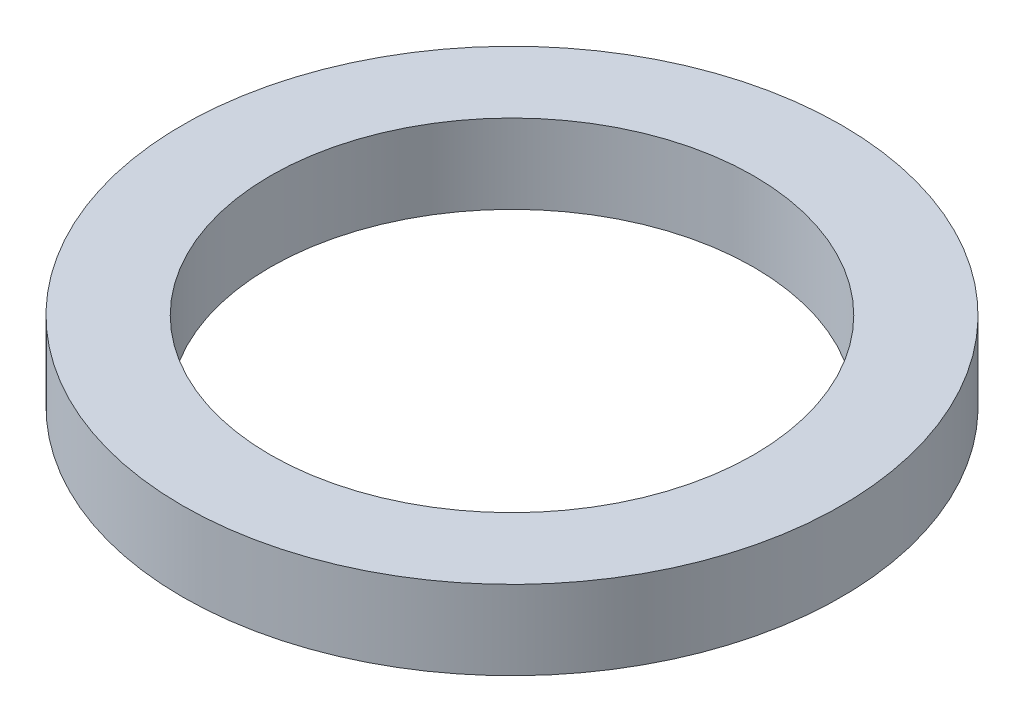
ISO-10303-21;
HEADER;
FILE_DESCRIPTION(('STEP AP214'),'2;1');
FILE_NAME('part.step','',(''),(''),'','','');
FILE_SCHEMA(('AUTOMOTIVE_DESIGN { 1 0 10303 214 1 1 1 1 }'));
ENDSEC;
DATA;
#1=APPLICATION_CONTEXT('core data for automotive mechanical design processes');
#2=APPLICATION_PROTOCOL_DEFINITION('international standard','automotive_design',2000,#1);
#3=PRODUCT_CONTEXT('',#1,'mechanical');
#4=PRODUCT('Part','Part','',(#3));
#5=PRODUCT_RELATED_PRODUCT_CATEGORY('part','',(#4));
#6=PRODUCT_DEFINITION_FORMATION('','',#4);
#7=PRODUCT_DEFINITION_CONTEXT('part definition',#1,'design');
#8=PRODUCT_DEFINITION('design','',#6,#7);
#9=PRODUCT_DEFINITION_SHAPE('','',#8);
#10=(LENGTH_UNIT() NAMED_UNIT(*) SI_UNIT(.MILLI.,.METRE.));
#11=(NAMED_UNIT(*) PLANE_ANGLE_UNIT() SI_UNIT($,.RADIAN.));
#12=(NAMED_UNIT(*) SI_UNIT($,.STERADIAN.) SOLID_ANGLE_UNIT());
#13=UNCERTAINTY_MEASURE_WITH_UNIT(LENGTH_MEASURE(1.E-05),#10,'distance_accuracy_value','');
#14=(GEOMETRIC_REPRESENTATION_CONTEXT(3) GLOBAL_UNCERTAINTY_ASSIGNED_CONTEXT((#13)) GLOBAL_UNIT_ASSIGNED_CONTEXT((#10,
#11,#12)) REPRESENTATION_CONTEXT('',''));
#15=CARTESIAN_POINT('',(0.,0.,0.));
#16=DIRECTION('',(0.,0.,1.));
#17=DIRECTION('',(1.,0.,0.));
#18=AXIS2_PLACEMENT_3D('',#15,#16,#17);
#19=CARTESIAN_POINT('',(0.,9.,0.));
#20=DIRECTION('',(0.,-1.,0.));
#21=DIRECTION('',(0.,0.,-1.));
#22=AXIS2_PLACEMENT_3D('',#19,#20,#21);
#23=CYLINDRICAL_SURFACE('',#22,37.5);
#24=CARTESIAN_POINT('',(0.,9.,0.));
#25=DIRECTION('',(0.,1.,0.));
#26=DIRECTION('',(0.,0.,1.));
#27=AXIS2_PLACEMENT_3D('',#24,#25,#26);
#28=CIRCLE('',#27,37.5);
#29=CARTESIAN_POINT('',(0.,9.,37.5));
#30=VERTEX_POINT('',#29);
#31=EDGE_CURVE('E10',#30,#30,#28,.T.);
#32=ORIENTED_EDGE('',*,*,#31,.F.);
#33=EDGE_LOOP('',(#32));
#34=FACE_BOUND('',#33,.T.);
#35=CARTESIAN_POINT('',(0.,0.,0.));
#36=DIRECTION('',(0.,1.,0.));
#37=DIRECTION('',(0.,0.,1.));
#38=AXIS2_PLACEMENT_3D('',#35,#36,#37);
#39=CIRCLE('',#38,37.5);
#40=CARTESIAN_POINT('',(0.,0.,37.5));
#41=VERTEX_POINT('',#40);
#42=EDGE_CURVE('E37',#41,#41,#39,.T.);
#43=ORIENTED_EDGE('',*,*,#42,.T.);
#44=EDGE_LOOP('',(#43));
#45=FACE_BOUND('',#44,.T.);
#46=ADVANCED_FACE('F40',(#34,#45),#23,.T.);
#47=CARTESIAN_POINT('',(0.,9.,0.));
#48=DIRECTION('',(0.,1.,0.));
#49=DIRECTION('',(0.,0.,1.));
#50=AXIS2_PLACEMENT_3D('',#47,#48,#49);
#51=PLANE('',#50);
#52=CARTESIAN_POINT('',(0.,9.,0.));
#53=DIRECTION('',(0.,1.,0.));
#54=DIRECTION('',(0.,0.,1.));
#55=AXIS2_PLACEMENT_3D('',#52,#53,#54);
#56=CIRCLE('',#55,27.5);
#57=CARTESIAN_POINT('',(0.,9.,27.5));
#58=VERTEX_POINT('',#57);
#59=EDGE_CURVE('E50',#58,#58,#56,.T.);
#60=ORIENTED_EDGE('',*,*,#59,.F.);
#61=EDGE_LOOP('',(#60));
#62=FACE_BOUND('',#61,.T.);
#63=ORIENTED_EDGE('',*,*,#31,.T.);
#64=EDGE_LOOP('',(#63));
#65=FACE_BOUND('',#64,.T.);
#66=ADVANCED_FACE('F59',(#62,#65),#51,.T.);
#67=CARTESIAN_POINT('',(0.,0.,0.));
#68=DIRECTION('',(0.,1.,0.));
#69=DIRECTION('',(0.,0.,1.));
#70=AXIS2_PLACEMENT_3D('',#67,#68,#69);
#71=PLANE('',#70);
#72=CARTESIAN_POINT('',(0.,0.,0.));
#73=DIRECTION('',(0.,1.,0.));
#74=DIRECTION('',(0.,0.,1.));
#75=AXIS2_PLACEMENT_3D('',#72,#73,#74);
#76=CIRCLE('',#75,27.5);
#77=CARTESIAN_POINT('',(0.,0.,27.5));
#78=VERTEX_POINT('',#77);
#79=EDGE_CURVE('E47',#78,#78,#76,.T.);
#80=ORIENTED_EDGE('',*,*,#79,.T.);
#81=EDGE_LOOP('',(#80));
#82=FACE_BOUND('',#81,.T.);
#83=ORIENTED_EDGE('',*,*,#42,.F.);
#84=EDGE_LOOP('',(#83));
#85=FACE_BOUND('',#84,.T.);
#86=ADVANCED_FACE('F58',(#82,#85),#71,.F.);
#87=CARTESIAN_POINT('',(0.,9.,0.));
#88=DIRECTION('',(0.,-1.,0.));
#89=DIRECTION('',(0.,0.,-1.));
#90=AXIS2_PLACEMENT_3D('',#87,#88,#89);
#91=CYLINDRICAL_SURFACE('',#90,27.5);
#92=ORIENTED_EDGE('',*,*,#59,.T.);
#93=EDGE_LOOP('',(#92));
#94=FACE_BOUND('',#93,.T.);
#95=ORIENTED_EDGE('',*,*,#79,.F.);
#96=EDGE_LOOP('',(#95));
#97=FACE_BOUND('',#96,.T.);
#98=ADVANCED_FACE('F54',(#94,#97),#91,.F.);
#99=CLOSED_SHELL('',(#46,#66,#86,#98));
#100=MANIFOLD_SOLID_BREP('B2',#99);
#101=ADVANCED_BREP_SHAPE_REPRESENTATION('',(#18,#100),#14);
#102=SHAPE_DEFINITION_REPRESENTATION(#9,#101);
ENDSEC;
END-ISO-10303-21;
